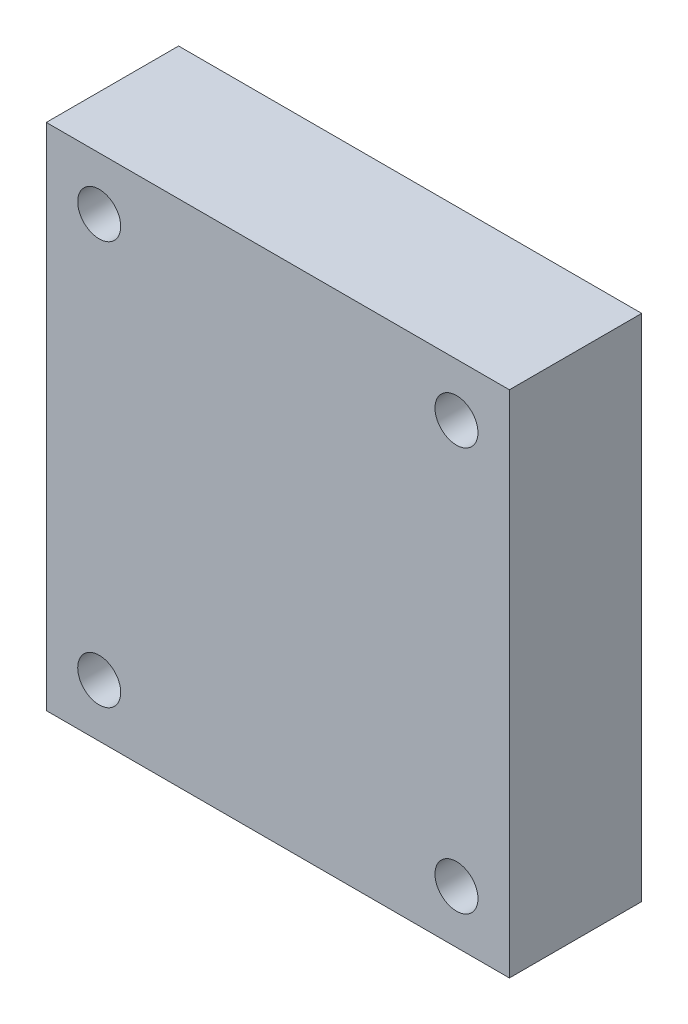
ISO-10303-21;
HEADER;
FILE_DESCRIPTION(('STEP AP214'),'2;1');
FILE_NAME('part.step','',(''),(''),'','','');
FILE_SCHEMA(('AUTOMOTIVE_DESIGN { 1 0 10303 214 1 1 1 1 }'));
ENDSEC;
DATA;
#1=APPLICATION_CONTEXT('core data for automotive mechanical design processes');
#2=APPLICATION_PROTOCOL_DEFINITION('international standard','automotive_design',2000,#1);
#3=PRODUCT_CONTEXT('',#1,'mechanical');
#4=PRODUCT('Part','Part','',(#3));
#5=PRODUCT_RELATED_PRODUCT_CATEGORY('part','',(#4));
#6=PRODUCT_DEFINITION_FORMATION('','',#4);
#7=PRODUCT_DEFINITION_CONTEXT('part definition',#1,'design');
#8=PRODUCT_DEFINITION('design','',#6,#7);
#9=PRODUCT_DEFINITION_SHAPE('','',#8);
#10=(LENGTH_UNIT() NAMED_UNIT(*) SI_UNIT(.MILLI.,.METRE.));
#11=(NAMED_UNIT(*) PLANE_ANGLE_UNIT() SI_UNIT($,.RADIAN.));
#12=(NAMED_UNIT(*) SI_UNIT($,.STERADIAN.) SOLID_ANGLE_UNIT());
#13=UNCERTAINTY_MEASURE_WITH_UNIT(LENGTH_MEASURE(1.E-05),#10,'distance_accuracy_value','');
#14=(GEOMETRIC_REPRESENTATION_CONTEXT(3) GLOBAL_UNCERTAINTY_ASSIGNED_CONTEXT((#13)) GLOBAL_UNIT_ASSIGNED_CONTEXT((#10,
#11,#12)) REPRESENTATION_CONTEXT('',''));
#15=CARTESIAN_POINT('',(0.,0.,0.));
#16=DIRECTION('',(0.,0.,1.));
#17=DIRECTION('',(1.,0.,0.));
#18=AXIS2_PLACEMENT_3D('',#15,#16,#17);
#19=CARTESIAN_POINT('',(0.,0.,20.));
#20=DIRECTION('',(0.,0.,-1.));
#21=DIRECTION('',(-1.,0.,0.));
#22=AXIS2_PLACEMENT_3D('',#19,#20,#21);
#23=PLANE('',#22);
#24=CARTESIAN_POINT('',(54.,-61.,20.));
#25=DIRECTION('',(0.,0.,1.));
#26=DIRECTION('',(1.,0.,0.));
#27=AXIS2_PLACEMENT_3D('',#24,#25,#26);
#28=CIRCLE('',#27,6.50000000000001);
#29=CARTESIAN_POINT('',(60.5000000000001,-61.,20.));
#30=VERTEX_POINT('',#29);
#31=EDGE_CURVE('E123',#30,#30,#28,.T.);
#32=ORIENTED_EDGE('',*,*,#31,.F.);
#33=EDGE_LOOP('',(#32));
#34=FACE_BOUND('',#33,.T.);
#35=CARTESIAN_POINT('',(-54.,61.,20.));
#36=DIRECTION('',(0.,0.,1.));
#37=DIRECTION('',(1.,0.,0.));
#38=AXIS2_PLACEMENT_3D('',#35,#36,#37);
#39=CIRCLE('',#38,6.50000000000001);
#40=CARTESIAN_POINT('',(-47.5,61.,20.));
#41=VERTEX_POINT('',#40);
#42=EDGE_CURVE('E102',#41,#41,#39,.T.);
#43=ORIENTED_EDGE('',*,*,#42,.F.);
#44=EDGE_LOOP('',(#43));
#45=FACE_BOUND('',#44,.T.);
#46=DIRECTION('',(0.,-1.,0.));
#47=VECTOR('',#46,1.);
#48=CARTESIAN_POINT('',(-70.,-77.,20.));
#49=LINE('',#48,#47);
#50=CARTESIAN_POINT('',(-70.,77.,20.));
#51=VERTEX_POINT('',#50);
#52=CARTESIAN_POINT('',(-70.,-77.,20.));
#53=VERTEX_POINT('',#52);
#54=EDGE_CURVE('E87',#51,#53,#49,.T.);
#55=ORIENTED_EDGE('',*,*,#54,.T.);
#56=DIRECTION('',(1.,0.,0.));
#57=VECTOR('',#56,1.);
#58=CARTESIAN_POINT('',(-70.,-77.,20.));
#59=LINE('',#58,#57);
#60=CARTESIAN_POINT('',(70.,-77.,20.));
#61=VERTEX_POINT('',#60);
#62=EDGE_CURVE('E82',#53,#61,#59,.T.);
#63=ORIENTED_EDGE('',*,*,#62,.T.);
#64=DIRECTION('',(0.,1.,0.));
#65=VECTOR('',#64,1.);
#66=CARTESIAN_POINT('',(70.,-77.,20.));
#67=LINE('',#66,#65);
#68=CARTESIAN_POINT('',(70.,77.,20.));
#69=VERTEX_POINT('',#68);
#70=EDGE_CURVE('E85',#61,#69,#67,.T.);
#71=ORIENTED_EDGE('',*,*,#70,.T.);
#72=DIRECTION('',(-1.,0.,0.));
#73=VECTOR('',#72,1.);
#74=CARTESIAN_POINT('',(-70.,77.,20.));
#75=LINE('',#74,#73);
#76=EDGE_CURVE('E52',#69,#51,#75,.T.);
#77=ORIENTED_EDGE('',*,*,#76,.T.);
#78=EDGE_LOOP('',(#55,#63,#71,#77));
#79=FACE_BOUND('',#78,.T.);
#80=CARTESIAN_POINT('',(54.,61.,20.));
#81=DIRECTION('',(0.,0.,1.));
#82=DIRECTION('',(-1.,0.,0.));
#83=AXIS2_PLACEMENT_3D('',#80,#81,#82);
#84=CIRCLE('',#83,6.50000000000001);
#85=CARTESIAN_POINT('',(47.5,61.,20.));
#86=VERTEX_POINT('',#85);
#87=EDGE_CURVE('E117',#86,#86,#84,.T.);
#88=ORIENTED_EDGE('',*,*,#87,.F.);
#89=EDGE_LOOP('',(#88));
#90=FACE_BOUND('',#89,.T.);
#91=CARTESIAN_POINT('',(-54.,-61.,20.));
#92=DIRECTION('',(0.,0.,1.));
#93=DIRECTION('',(-1.,0.,0.));
#94=AXIS2_PLACEMENT_3D('',#91,#92,#93);
#95=CIRCLE('',#94,6.50000000000001);
#96=CARTESIAN_POINT('',(-60.5,-61.,20.));
#97=VERTEX_POINT('',#96);
#98=EDGE_CURVE('E129',#97,#97,#95,.T.);
#99=ORIENTED_EDGE('',*,*,#98,.F.);
#100=EDGE_LOOP('',(#99));
#101=FACE_BOUND('',#100,.T.);
#102=ADVANCED_FACE('F35',(#34,#45,#79,#90,#101),#23,.F.);
#103=CARTESIAN_POINT('',(0.,0.,-20.));
#104=DIRECTION('',(0.,0.,-1.));
#105=DIRECTION('',(-1.,0.,0.));
#106=AXIS2_PLACEMENT_3D('',#103,#104,#105);
#107=PLANE('',#106);
#108=CARTESIAN_POINT('',(54.,-61.,-20.));
#109=DIRECTION('',(0.,0.,1.));
#110=DIRECTION('',(1.,0.,0.));
#111=AXIS2_PLACEMENT_3D('',#108,#109,#110);
#112=CIRCLE('',#111,6.50000000000001);
#113=CARTESIAN_POINT('',(60.5000000000001,-61.,-20.));
#114=VERTEX_POINT('',#113);
#115=EDGE_CURVE('E126',#114,#114,#112,.T.);
#116=ORIENTED_EDGE('',*,*,#115,.T.);
#117=EDGE_LOOP('',(#116));
#118=FACE_BOUND('',#117,.T.);
#119=CARTESIAN_POINT('',(-54.,61.,-20.));
#120=DIRECTION('',(0.,0.,1.));
#121=DIRECTION('',(1.,0.,0.));
#122=AXIS2_PLACEMENT_3D('',#119,#120,#121);
#123=CIRCLE('',#122,6.50000000000001);
#124=CARTESIAN_POINT('',(-47.5,61.,-20.));
#125=VERTEX_POINT('',#124);
#126=EDGE_CURVE('E114',#125,#125,#123,.T.);
#127=ORIENTED_EDGE('',*,*,#126,.T.);
#128=EDGE_LOOP('',(#127));
#129=FACE_BOUND('',#128,.T.);
#130=DIRECTION('',(0.,-1.,0.));
#131=VECTOR('',#130,1.);
#132=CARTESIAN_POINT('',(-70.,-77.,-20.));
#133=LINE('',#132,#131);
#134=CARTESIAN_POINT('',(-70.,77.,-20.));
#135=VERTEX_POINT('',#134);
#136=CARTESIAN_POINT('',(-70.,-77.,-20.));
#137=VERTEX_POINT('',#136);
#138=EDGE_CURVE('E99',#135,#137,#133,.T.);
#139=ORIENTED_EDGE('',*,*,#138,.F.);
#140=DIRECTION('',(-1.,0.,0.));
#141=VECTOR('',#140,1.);
#142=CARTESIAN_POINT('',(-70.,77.,-20.));
#143=LINE('',#142,#141);
#144=CARTESIAN_POINT('',(70.,77.,-20.));
#145=VERTEX_POINT('',#144);
#146=EDGE_CURVE('E75',#145,#135,#143,.T.);
#147=ORIENTED_EDGE('',*,*,#146,.F.);
#148=DIRECTION('',(0.,1.,0.));
#149=VECTOR('',#148,1.);
#150=CARTESIAN_POINT('',(70.,-77.,-20.));
#151=LINE('',#150,#149);
#152=CARTESIAN_POINT('',(70.,-77.,-20.));
#153=VERTEX_POINT('',#152);
#154=EDGE_CURVE('E69',#153,#145,#151,.T.);
#155=ORIENTED_EDGE('',*,*,#154,.F.);
#156=DIRECTION('',(1.,0.,0.));
#157=VECTOR('',#156,1.);
#158=CARTESIAN_POINT('',(-70.,-77.,-20.));
#159=LINE('',#158,#157);
#160=EDGE_CURVE('E91',#137,#153,#159,.T.);
#161=ORIENTED_EDGE('',*,*,#160,.F.);
#162=EDGE_LOOP('',(#139,#147,#155,#161));
#163=FACE_BOUND('',#162,.T.);
#164=CARTESIAN_POINT('',(54.,61.,-20.));
#165=DIRECTION('',(0.,0.,1.));
#166=DIRECTION('',(-1.,0.,0.));
#167=AXIS2_PLACEMENT_3D('',#164,#165,#166);
#168=CIRCLE('',#167,6.50000000000001);
#169=CARTESIAN_POINT('',(47.5,61.,-20.));
#170=VERTEX_POINT('',#169);
#171=EDGE_CURVE('E120',#170,#170,#168,.T.);
#172=ORIENTED_EDGE('',*,*,#171,.T.);
#173=EDGE_LOOP('',(#172));
#174=FACE_BOUND('',#173,.T.);
#175=CARTESIAN_POINT('',(-54.,-61.,-20.));
#176=DIRECTION('',(0.,0.,1.));
#177=DIRECTION('',(-1.,0.,0.));
#178=AXIS2_PLACEMENT_3D('',#175,#176,#177);
#179=CIRCLE('',#178,6.50000000000001);
#180=CARTESIAN_POINT('',(-60.5,-61.,-20.));
#181=VERTEX_POINT('',#180);
#182=EDGE_CURVE('E132',#181,#181,#179,.T.);
#183=ORIENTED_EDGE('',*,*,#182,.T.);
#184=EDGE_LOOP('',(#183));
#185=FACE_BOUND('',#184,.T.);
#186=ADVANCED_FACE('F110',(#118,#129,#163,#174,#185),#107,.T.);
#187=CARTESIAN_POINT('',(-70.,-77.,20.));
#188=DIRECTION('',(1.,0.,0.));
#189=DIRECTION('',(0.,0.,-1.));
#190=AXIS2_PLACEMENT_3D('',#187,#188,#189);
#191=PLANE('',#190);
#192=ORIENTED_EDGE('',*,*,#138,.T.);
#193=DIRECTION('',(0.,0.,-1.));
#194=VECTOR('',#193,1.);
#195=CARTESIAN_POINT('',(-70.,-77.,20.));
#196=LINE('',#195,#194);
#197=EDGE_CURVE('E11',#53,#137,#196,.T.);
#198=ORIENTED_EDGE('',*,*,#197,.F.);
#199=ORIENTED_EDGE('',*,*,#54,.F.);
#200=DIRECTION('',(0.,0.,-1.));
#201=VECTOR('',#200,1.);
#202=CARTESIAN_POINT('',(-70.,77.,20.));
#203=LINE('',#202,#201);
#204=EDGE_CURVE('E95',#51,#135,#203,.T.);
#205=ORIENTED_EDGE('',*,*,#204,.T.);
#206=EDGE_LOOP('',(#192,#198,#199,#205));
#207=FACE_BOUND('',#206,.T.);
#208=ADVANCED_FACE('F37',(#207),#191,.F.);
#209=CARTESIAN_POINT('',(-70.,-77.,20.));
#210=DIRECTION('',(0.,1.,0.));
#211=DIRECTION('',(0.,0.,1.));
#212=AXIS2_PLACEMENT_3D('',#209,#210,#211);
#213=PLANE('',#212);
#214=ORIENTED_EDGE('',*,*,#160,.T.);
#215=DIRECTION('',(0.,0.,-1.));
#216=VECTOR('',#215,1.);
#217=CARTESIAN_POINT('',(70.,-77.,20.));
#218=LINE('',#217,#216);
#219=EDGE_CURVE('E44',#61,#153,#218,.T.);
#220=ORIENTED_EDGE('',*,*,#219,.F.);
#221=ORIENTED_EDGE('',*,*,#62,.F.);
#222=ORIENTED_EDGE('',*,*,#197,.T.);
#223=EDGE_LOOP('',(#214,#220,#221,#222));
#224=FACE_BOUND('',#223,.T.);
#225=ADVANCED_FACE('F90',(#224),#213,.F.);
#226=CARTESIAN_POINT('',(70.,-77.,20.));
#227=DIRECTION('',(-1.,0.,0.));
#228=DIRECTION('',(0.,0.,1.));
#229=AXIS2_PLACEMENT_3D('',#226,#227,#228);
#230=PLANE('',#229);
#231=ORIENTED_EDGE('',*,*,#154,.T.);
#232=DIRECTION('',(0.,0.,-1.));
#233=VECTOR('',#232,1.);
#234=CARTESIAN_POINT('',(70.,77.,20.));
#235=LINE('',#234,#233);
#236=EDGE_CURVE('E92',#69,#145,#235,.T.);
#237=ORIENTED_EDGE('',*,*,#236,.F.);
#238=ORIENTED_EDGE('',*,*,#70,.F.);
#239=ORIENTED_EDGE('',*,*,#219,.T.);
#240=EDGE_LOOP('',(#231,#237,#238,#239));
#241=FACE_BOUND('',#240,.T.);
#242=ADVANCED_FACE('F93',(#241),#230,.F.);
#243=CARTESIAN_POINT('',(-70.,77.,20.));
#244=DIRECTION('',(0.,-1.,0.));
#245=DIRECTION('',(0.,0.,-1.));
#246=AXIS2_PLACEMENT_3D('',#243,#244,#245);
#247=PLANE('',#246);
#248=ORIENTED_EDGE('',*,*,#146,.T.);
#249=ORIENTED_EDGE('',*,*,#204,.F.);
#250=ORIENTED_EDGE('',*,*,#76,.F.);
#251=ORIENTED_EDGE('',*,*,#236,.T.);
#252=EDGE_LOOP('',(#248,#249,#250,#251));
#253=FACE_BOUND('',#252,.T.);
#254=ADVANCED_FACE('F107',(#253),#247,.F.);
#255=CARTESIAN_POINT('',(-54.,61.,20.));
#256=DIRECTION('',(0.,0.,-1.));
#257=DIRECTION('',(-1.,0.,0.));
#258=AXIS2_PLACEMENT_3D('',#255,#256,#257);
#259=CYLINDRICAL_SURFACE('',#258,6.50000000000001);
#260=ORIENTED_EDGE('',*,*,#42,.T.);
#261=EDGE_LOOP('',(#260));
#262=FACE_BOUND('',#261,.T.);
#263=ORIENTED_EDGE('',*,*,#126,.F.);
#264=EDGE_LOOP('',(#263));
#265=FACE_BOUND('',#264,.T.);
#266=ADVANCED_FACE('F152',(#262,#265),#259,.F.);
#267=CARTESIAN_POINT('',(54.,61.,20.));
#268=DIRECTION('',(0.,0.,-1.));
#269=DIRECTION('',(-1.,0.,0.));
#270=AXIS2_PLACEMENT_3D('',#267,#268,#269);
#271=CYLINDRICAL_SURFACE('',#270,6.50000000000001);
#272=ORIENTED_EDGE('',*,*,#87,.T.);
#273=EDGE_LOOP('',(#272));
#274=FACE_BOUND('',#273,.T.);
#275=ORIENTED_EDGE('',*,*,#171,.F.);
#276=EDGE_LOOP('',(#275));
#277=FACE_BOUND('',#276,.T.);
#278=ADVANCED_FACE('F198',(#274,#277),#271,.F.);
#279=CARTESIAN_POINT('',(54.,-61.,20.));
#280=DIRECTION('',(0.,0.,-1.));
#281=DIRECTION('',(-1.,0.,0.));
#282=AXIS2_PLACEMENT_3D('',#279,#280,#281);
#283=CYLINDRICAL_SURFACE('',#282,6.50000000000001);
#284=ORIENTED_EDGE('',*,*,#31,.T.);
#285=EDGE_LOOP('',(#284));
#286=FACE_BOUND('',#285,.T.);
#287=ORIENTED_EDGE('',*,*,#115,.F.);
#288=EDGE_LOOP('',(#287));
#289=FACE_BOUND('',#288,.T.);
#290=ADVANCED_FACE('F206',(#286,#289),#283,.F.);
#291=CARTESIAN_POINT('',(-54.,-61.,20.));
#292=DIRECTION('',(0.,0.,-1.));
#293=DIRECTION('',(-1.,0.,0.));
#294=AXIS2_PLACEMENT_3D('',#291,#292,#293);
#295=CYLINDRICAL_SURFACE('',#294,6.50000000000001);
#296=ORIENTED_EDGE('',*,*,#98,.T.);
#297=EDGE_LOOP('',(#296));
#298=FACE_BOUND('',#297,.T.);
#299=ORIENTED_EDGE('',*,*,#182,.F.);
#300=EDGE_LOOP('',(#299));
#301=FACE_BOUND('',#300,.T.);
#302=ADVANCED_FACE('F138',(#298,#301),#295,.F.);
#303=CLOSED_SHELL('',(#102,#186,#208,#225,#242,#254,#266,#278,#290,#302));
#304=MANIFOLD_SOLID_BREP('B2',#303);
#305=ADVANCED_BREP_SHAPE_REPRESENTATION('',(#18,#304),#14);
#306=SHAPE_DEFINITION_REPRESENTATION(#9,#305);
ENDSEC;
END-ISO-10303-21;
